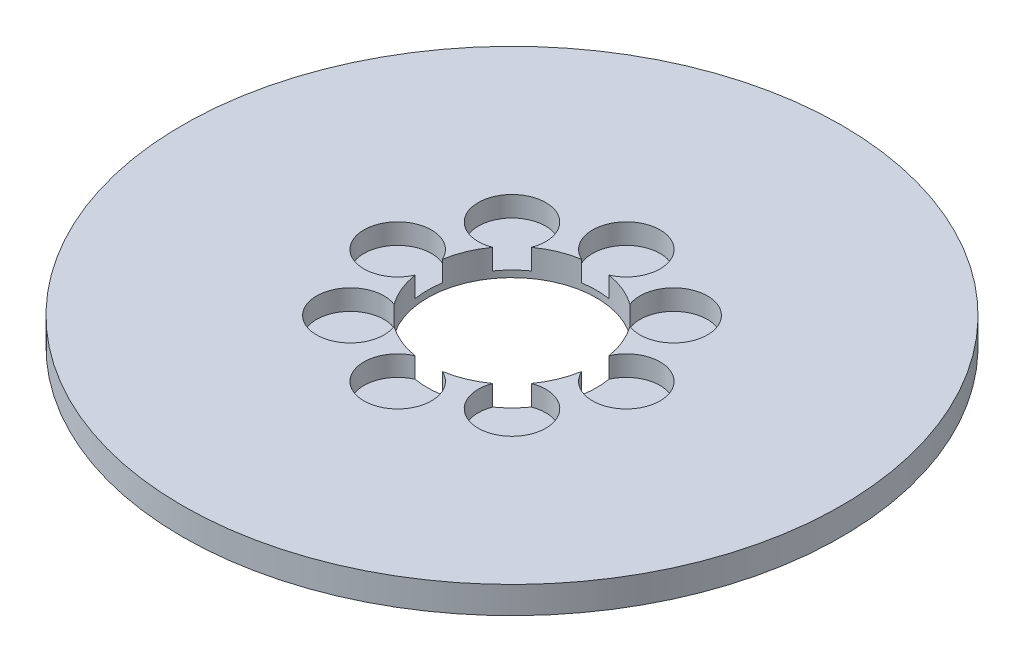
ISO-10303-21;
HEADER;
FILE_DESCRIPTION(('STEP AP214'),'2;1');
FILE_NAME('part.step','',(''),(''),'','','');
FILE_SCHEMA(('AUTOMOTIVE_DESIGN { 1 0 10303 214 1 1 1 1 }'));
ENDSEC;
DATA;
#1=APPLICATION_CONTEXT('core data for automotive mechanical design processes');
#2=APPLICATION_PROTOCOL_DEFINITION('international standard','automotive_design',2000,#1);
#3=PRODUCT_CONTEXT('',#1,'mechanical');
#4=PRODUCT('Part','Part','',(#3));
#5=PRODUCT_RELATED_PRODUCT_CATEGORY('part','',(#4));
#6=PRODUCT_DEFINITION_FORMATION('','',#4);
#7=PRODUCT_DEFINITION_CONTEXT('part definition',#1,'design');
#8=PRODUCT_DEFINITION('design','',#6,#7);
#9=PRODUCT_DEFINITION_SHAPE('','',#8);
#10=(LENGTH_UNIT() NAMED_UNIT(*) SI_UNIT(.MILLI.,.METRE.));
#11=(NAMED_UNIT(*) PLANE_ANGLE_UNIT() SI_UNIT($,.RADIAN.));
#12=(NAMED_UNIT(*) SI_UNIT($,.STERADIAN.) SOLID_ANGLE_UNIT());
#13=UNCERTAINTY_MEASURE_WITH_UNIT(LENGTH_MEASURE(1.E-05),#10,'distance_accuracy_value','');
#14=(GEOMETRIC_REPRESENTATION_CONTEXT(3) GLOBAL_UNCERTAINTY_ASSIGNED_CONTEXT((#13)) GLOBAL_UNIT_ASSIGNED_CONTEXT((#10,
#11,#12)) REPRESENTATION_CONTEXT('',''));
#15=CARTESIAN_POINT('',(0.,0.,0.));
#16=DIRECTION('',(0.,0.,1.));
#17=DIRECTION('',(1.,0.,0.));
#18=AXIS2_PLACEMENT_3D('',#15,#16,#17);
#19=CARTESIAN_POINT('',(0.,8.,0.));
#20=DIRECTION('',(0.,-1.,0.));
#21=DIRECTION('',(0.,0.,-1.));
#22=AXIS2_PLACEMENT_3D('',#19,#20,#21);
#23=CYLINDRICAL_SURFACE('',#22,97.5);
#24=CARTESIAN_POINT('',(0.,8.,0.));
#25=DIRECTION('',(0.,1.,0.));
#26=DIRECTION('',(0.,0.,1.));
#27=AXIS2_PLACEMENT_3D('',#24,#25,#26);
#28=CIRCLE('',#27,97.5);
#29=CARTESIAN_POINT('',(0.,8.,97.5));
#30=VERTEX_POINT('',#29);
#31=EDGE_CURVE('E195',#30,#30,#28,.T.);
#32=ORIENTED_EDGE('',*,*,#31,.F.);
#33=EDGE_LOOP('',(#32));
#34=FACE_BOUND('',#33,.T.);
#35=CARTESIAN_POINT('',(0.,0.,0.));
#36=DIRECTION('',(0.,1.,0.));
#37=DIRECTION('',(0.,0.,1.));
#38=AXIS2_PLACEMENT_3D('',#35,#36,#37);
#39=CIRCLE('',#38,97.5);
#40=CARTESIAN_POINT('',(0.,0.,97.5));
#41=VERTEX_POINT('',#40);
#42=EDGE_CURVE('E179',#41,#41,#39,.T.);
#43=ORIENTED_EDGE('',*,*,#42,.T.);
#44=EDGE_LOOP('',(#43));
#45=FACE_BOUND('',#44,.T.);
#46=ADVANCED_FACE('F39',(#34,#45),#23,.T.);
#47=CARTESIAN_POINT('',(0.,8.,0.));
#48=DIRECTION('',(0.,1.,0.));
#49=DIRECTION('',(0.,0.,1.));
#50=AXIS2_PLACEMENT_3D('',#47,#48,#49);
#51=PLANE('',#50);
#52=CARTESIAN_POINT('',(1.18084923532619E-13,8.,33.8208662950337));
#53=DIRECTION('',(0.,1.,0.));
#54=DIRECTION('',(1.,0.,0.));
#55=AXIS2_PLACEMENT_3D('',#52,#53,#54);
#56=CIRCLE('',#55,10.);
#57=CARTESIAN_POINT('',(-4.03691324760704,8.,24.6719138177664));
#58=VERTEX_POINT('',#57);
#59=CARTESIAN_POINT('',(4.03691324760721,8.,24.6719138177664));
#60=VERTEX_POINT('',#59);
#61=EDGE_CURVE('E176',#58,#60,#56,.T.);
#62=ORIENTED_EDGE('',*,*,#61,.F.);
#63=CARTESIAN_POINT('',(0.,8.,0.));
#64=DIRECTION('',(0.,1.,0.));
#65=DIRECTION('',(0.,0.,1.));
#66=AXIS2_PLACEMENT_3D('',#63,#64,#65);
#67=CIRCLE('',#66,25.);
#68=CARTESIAN_POINT('',(-14.5911488329479,8.,20.3002062978376));
#69=VERTEX_POINT('',#68);
#70=EDGE_CURVE('E166',#69,#58,#67,.T.);
#71=ORIENTED_EDGE('',*,*,#70,.F.);
#72=CARTESIAN_POINT('',(-23.9149639028218,8.,23.9149639028219));
#73=DIRECTION('',(0.,1.,0.));
#74=DIRECTION('',(0.707106781186549,0.,0.707106781186546));
#75=AXIS2_PLACEMENT_3D('',#72,#73,#74);
#76=CIRCLE('',#75,10.);
#77=CARTESIAN_POINT('',(-20.3002062978375,8.,14.591148832948));
#78=VERTEX_POINT('',#77);
#79=EDGE_CURVE('E147',#78,#69,#76,.T.);
#80=ORIENTED_EDGE('',*,*,#79,.F.);
#81=CARTESIAN_POINT('',(-24.6719138177664,8.,4.03691324760713));
#82=VERTEX_POINT('',#81);
#83=EDGE_CURVE('E180',#82,#78,#67,.T.);
#84=ORIENTED_EDGE('',*,*,#83,.F.);
#85=CARTESIAN_POINT('',(-33.8208662950337,8.,0.));
#86=DIRECTION('',(0.,1.,0.));
#87=DIRECTION('',(0.,0.,1.));
#88=AXIS2_PLACEMENT_3D('',#85,#86,#87);
#89=CIRCLE('',#88,10.);
#90=CARTESIAN_POINT('',(-24.6719138177664,8.,-4.03691324760713));
#91=VERTEX_POINT('',#90);
#92=EDGE_CURVE('E186',#91,#82,#89,.T.);
#93=ORIENTED_EDGE('',*,*,#92,.F.);
#94=CARTESIAN_POINT('',(-20.3002062978377,8.,-14.5911488329477));
#95=VERTEX_POINT('',#94);
#96=EDGE_CURVE('E182',#95,#91,#67,.T.);
#97=ORIENTED_EDGE('',*,*,#96,.F.);
#98=CARTESIAN_POINT('',(-23.9149639028221,8.,-23.9149639028216));
#99=DIRECTION('',(0.,1.,0.));
#100=DIRECTION('',(-0.707106781186539,0.,0.707106781186556));
#101=AXIS2_PLACEMENT_3D('',#98,#99,#100);
#102=CIRCLE('',#101,10.);
#103=CARTESIAN_POINT('',(-14.5911488329482,8.,-20.3002062978374));
#104=VERTEX_POINT('',#103);
#105=EDGE_CURVE('E446',#104,#95,#102,.T.);
#106=ORIENTED_EDGE('',*,*,#105,.F.);
#107=CARTESIAN_POINT('',(-4.03691324760739,8.,-24.6719138177664));
#108=VERTEX_POINT('',#107);
#109=EDGE_CURVE('E452',#108,#104,#67,.T.);
#110=ORIENTED_EDGE('',*,*,#109,.F.);
#111=CARTESIAN_POINT('',(-3.54254770597856E-13,8.,-33.8208662950337));
#112=DIRECTION('',(0.,1.,0.));
#113=DIRECTION('',(-1.,0.,0.));
#114=AXIS2_PLACEMENT_3D('',#111,#112,#113);
#115=CIRCLE('',#114,10.);
#116=CARTESIAN_POINT('',(4.03691324760687,8.,-24.6719138177665));
#117=VERTEX_POINT('',#116);
#118=EDGE_CURVE('E477',#117,#108,#115,.T.);
#119=ORIENTED_EDGE('',*,*,#118,.F.);
#120=CARTESIAN_POINT('',(14.5911488329477,8.,-20.3002062978377));
#121=VERTEX_POINT('',#120);
#122=EDGE_CURVE('E460',#121,#117,#67,.T.);
#123=ORIENTED_EDGE('',*,*,#122,.F.);
#124=CARTESIAN_POINT('',(23.9149639028216,8.,-23.9149639028221));
#125=DIRECTION('',(0.,1.,0.));
#126=DIRECTION('',(-0.707106781186554,0.,-0.707106781186541));
#127=AXIS2_PLACEMENT_3D('',#124,#125,#126);
#128=CIRCLE('',#127,10.);
#129=CARTESIAN_POINT('',(20.3002062978374,8.,-14.5911488329481));
#130=VERTEX_POINT('',#129);
#131=EDGE_CURVE('E464',#130,#121,#128,.T.);
#132=ORIENTED_EDGE('',*,*,#131,.F.);
#133=CARTESIAN_POINT('',(24.6719138177664,8.,-4.03691324760713));
#134=VERTEX_POINT('',#133);
#135=EDGE_CURVE('E459',#134,#130,#67,.T.);
#136=ORIENTED_EDGE('',*,*,#135,.F.);
#137=CARTESIAN_POINT('',(33.8208662950337,8.,0.));
#138=DIRECTION('',(0.,1.,0.));
#139=DIRECTION('',(0.,0.,-1.));
#140=AXIS2_PLACEMENT_3D('',#137,#138,#139);
#141=CIRCLE('',#140,10.);
#142=CARTESIAN_POINT('',(24.6719138177664,8.,4.03691324760713));
#143=VERTEX_POINT('',#142);
#144=EDGE_CURVE('E469',#143,#134,#141,.T.);
#145=ORIENTED_EDGE('',*,*,#144,.F.);
#146=CARTESIAN_POINT('',(20.3002062978376,8.,14.5911488329478));
#147=VERTEX_POINT('',#146);
#148=EDGE_CURVE('E181',#147,#143,#67,.T.);
#149=ORIENTED_EDGE('',*,*,#148,.F.);
#150=CARTESIAN_POINT('',(23.914963902822,8.,23.9149639028217));
#151=DIRECTION('',(0.,1.,0.));
#152=DIRECTION('',(0.707106781186544,0.,-0.707106781186551));
#153=AXIS2_PLACEMENT_3D('',#150,#151,#152);
#154=CIRCLE('',#153,10.);
#155=CARTESIAN_POINT('',(14.591148832948,8.,20.3002062978375));
#156=VERTEX_POINT('',#155);
#157=EDGE_CURVE('E475',#156,#147,#154,.T.);
#158=ORIENTED_EDGE('',*,*,#157,.F.);
#159=EDGE_CURVE('E177',#60,#156,#67,.T.);
#160=ORIENTED_EDGE('',*,*,#159,.F.);
#161=EDGE_LOOP('',(#62,#71,#80,#84,#93,#97,#106,#110,#119,#123,#132,#136,#145,#149,#158,#160));
#162=FACE_BOUND('',#161,.T.);
#163=ORIENTED_EDGE('',*,*,#31,.T.);
#164=EDGE_LOOP('',(#163));
#165=FACE_BOUND('',#164,.T.);
#166=ADVANCED_FACE('F172',(#162,#165),#51,.T.);
#167=CARTESIAN_POINT('',(0.,0.,0.));
#168=DIRECTION('',(0.,1.,0.));
#169=DIRECTION('',(0.,0.,1.));
#170=AXIS2_PLACEMENT_3D('',#167,#168,#169);
#171=PLANE('',#170);
#172=CARTESIAN_POINT('',(0.,0.,0.));
#173=DIRECTION('',(0.,1.,0.));
#174=DIRECTION('',(0.,0.,1.));
#175=AXIS2_PLACEMENT_3D('',#172,#173,#174);
#176=CIRCLE('',#175,25.);
#177=CARTESIAN_POINT('',(0.,0.,25.));
#178=VERTEX_POINT('',#177);
#179=EDGE_CURVE('E187',#178,#178,#176,.T.);
#180=ORIENTED_EDGE('',*,*,#179,.T.);
#181=EDGE_LOOP('',(#180));
#182=FACE_BOUND('',#181,.T.);
#183=ORIENTED_EDGE('',*,*,#42,.F.);
#184=EDGE_LOOP('',(#183));
#185=FACE_BOUND('',#184,.T.);
#186=ADVANCED_FACE('F270',(#182,#185),#171,.F.);
#187=CARTESIAN_POINT('',(0.,8.,0.));
#188=DIRECTION('',(0.,-1.,0.));
#189=DIRECTION('',(0.,0.,-1.));
#190=AXIS2_PLACEMENT_3D('',#187,#188,#189);
#191=CYLINDRICAL_SURFACE('',#190,25.);
#192=DIRECTION('',(0.,1.,0.));
#193=VECTOR('',#192,1.);
#194=CARTESIAN_POINT('',(-4.03691324760705,4.97823933550777,24.6719138177664));
#195=LINE('',#194,#193);
#196=CARTESIAN_POINT('',(-4.03691324760704,1.95647867101555,24.6719138177664));
#197=VERTEX_POINT('',#196);
#198=EDGE_CURVE('E11',#197,#58,#195,.T.);
#199=ORIENTED_EDGE('',*,*,#198,.F.);
#200=CARTESIAN_POINT('',(0.,1.95647867101555,0.));
#201=DIRECTION('',(0.,1.,0.));
#202=DIRECTION('',(0.,0.,1.));
#203=AXIS2_PLACEMENT_3D('',#200,#201,#202);
#204=CIRCLE('',#203,25.);
#205=CARTESIAN_POINT('',(4.03691324760721,1.95647867101555,24.6719138177664));
#206=VERTEX_POINT('',#205);
#207=EDGE_CURVE('E250',#197,#206,#204,.T.);
#208=ORIENTED_EDGE('',*,*,#207,.T.);
#209=DIRECTION('',(0.,1.,0.));
#210=VECTOR('',#209,1.);
#211=CARTESIAN_POINT('',(4.03691324760722,4.97823933550777,24.6719138177664));
#212=LINE('',#211,#210);
#213=EDGE_CURVE('E46',#60,#206,#212,.F.);
#214=ORIENTED_EDGE('',*,*,#213,.F.);
#215=ORIENTED_EDGE('',*,*,#159,.T.);
#216=DIRECTION('',(0.,1.,0.));
#217=VECTOR('',#216,1.);
#218=CARTESIAN_POINT('',(14.591148832948,4.97823933550777,20.3002062978375));
#219=LINE('',#218,#217);
#220=CARTESIAN_POINT('',(14.591148832948,1.95647867101555,20.3002062978375));
#221=VERTEX_POINT('',#220);
#222=EDGE_CURVE('E244',#221,#156,#219,.T.);
#223=ORIENTED_EDGE('',*,*,#222,.F.);
#224=CARTESIAN_POINT('',(0.,1.95647867101555,0.));
#225=DIRECTION('',(0.,1.,0.));
#226=DIRECTION('',(0.,0.,1.));
#227=AXIS2_PLACEMENT_3D('',#224,#225,#226);
#228=CIRCLE('',#227,25.);
#229=CARTESIAN_POINT('',(20.3002062978376,1.95647867101555,14.5911488329478));
#230=VERTEX_POINT('',#229);
#231=EDGE_CURVE('E238',#221,#230,#228,.T.);
#232=ORIENTED_EDGE('',*,*,#231,.T.);
#233=DIRECTION('',(0.,1.,0.));
#234=VECTOR('',#233,1.);
#235=CARTESIAN_POINT('',(20.3002062978376,4.97823933550777,14.5911488329478));
#236=LINE('',#235,#234);
#237=EDGE_CURVE('E242',#147,#230,#236,.F.);
#238=ORIENTED_EDGE('',*,*,#237,.F.);
#239=ORIENTED_EDGE('',*,*,#148,.T.);
#240=DIRECTION('',(0.,1.,0.));
#241=VECTOR('',#240,1.);
#242=CARTESIAN_POINT('',(24.6719138177664,4.97823933550777,4.03691324760713));
#243=LINE('',#242,#241);
#244=CARTESIAN_POINT('',(24.6719138177664,1.95647867101555,4.03691324760713));
#245=VERTEX_POINT('',#244);
#246=EDGE_CURVE('E236',#245,#143,#243,.T.);
#247=ORIENTED_EDGE('',*,*,#246,.F.);
#248=CARTESIAN_POINT('',(0.,1.95647867101555,0.));
#249=DIRECTION('',(0.,1.,0.));
#250=DIRECTION('',(0.,0.,1.));
#251=AXIS2_PLACEMENT_3D('',#248,#249,#250);
#252=CIRCLE('',#251,25.);
#253=CARTESIAN_POINT('',(24.6719138177664,1.95647867101555,-4.03691324760713));
#254=VERTEX_POINT('',#253);
#255=EDGE_CURVE('E235',#245,#254,#252,.T.);
#256=ORIENTED_EDGE('',*,*,#255,.T.);
#257=DIRECTION('',(0.,1.,0.));
#258=VECTOR('',#257,1.);
#259=CARTESIAN_POINT('',(24.6719138177664,4.97823933550777,-4.03691324760713));
#260=LINE('',#259,#258);
#261=EDGE_CURVE('E234',#134,#254,#260,.F.);
#262=ORIENTED_EDGE('',*,*,#261,.F.);
#263=ORIENTED_EDGE('',*,*,#135,.T.);
#264=DIRECTION('',(0.,1.,0.));
#265=VECTOR('',#264,1.);
#266=CARTESIAN_POINT('',(20.3002062978374,4.97823933550777,-14.5911488329481));
#267=LINE('',#266,#265);
#268=CARTESIAN_POINT('',(20.3002062978374,1.95647867101555,-14.5911488329481));
#269=VERTEX_POINT('',#268);
#270=EDGE_CURVE('E229',#269,#130,#267,.T.);
#271=ORIENTED_EDGE('',*,*,#270,.F.);
#272=CARTESIAN_POINT('',(0.,1.95647867101555,0.));
#273=DIRECTION('',(0.,1.,0.));
#274=DIRECTION('',(0.,0.,1.));
#275=AXIS2_PLACEMENT_3D('',#272,#273,#274);
#276=CIRCLE('',#275,25.);
#277=CARTESIAN_POINT('',(14.5911488329477,1.95647867101555,-20.3002062978377));
#278=VERTEX_POINT('',#277);
#279=EDGE_CURVE('E221',#269,#278,#276,.T.);
#280=ORIENTED_EDGE('',*,*,#279,.T.);
#281=DIRECTION('',(0.,1.,0.));
#282=VECTOR('',#281,1.);
#283=CARTESIAN_POINT('',(14.5911488329477,4.97823933550777,-20.3002062978377));
#284=LINE('',#283,#282);
#285=EDGE_CURVE('E230',#121,#278,#284,.F.);
#286=ORIENTED_EDGE('',*,*,#285,.F.);
#287=ORIENTED_EDGE('',*,*,#122,.T.);
#288=DIRECTION('',(0.,1.,0.));
#289=VECTOR('',#288,1.);
#290=CARTESIAN_POINT('',(4.03691324760688,4.97823933550777,-24.6719138177665));
#291=LINE('',#290,#289);
#292=CARTESIAN_POINT('',(4.03691324760687,1.95647867101555,-24.6719138177665));
#293=VERTEX_POINT('',#292);
#294=EDGE_CURVE('E225',#293,#117,#291,.T.);
#295=ORIENTED_EDGE('',*,*,#294,.F.);
#296=CARTESIAN_POINT('',(0.,1.95647867101555,0.));
#297=DIRECTION('',(0.,1.,0.));
#298=DIRECTION('',(0.,0.,1.));
#299=AXIS2_PLACEMENT_3D('',#296,#297,#298);
#300=CIRCLE('',#299,25.);
#301=CARTESIAN_POINT('',(-4.03691324760739,1.95647867101555,-24.6719138177664));
#302=VERTEX_POINT('',#301);
#303=EDGE_CURVE('E216',#293,#302,#300,.T.);
#304=ORIENTED_EDGE('',*,*,#303,.T.);
#305=DIRECTION('',(0.,1.,0.));
#306=VECTOR('',#305,1.);
#307=CARTESIAN_POINT('',(-4.03691324760739,4.97823933550777,-24.6719138177664));
#308=LINE('',#307,#306);
#309=EDGE_CURVE('E218',#108,#302,#308,.F.);
#310=ORIENTED_EDGE('',*,*,#309,.F.);
#311=ORIENTED_EDGE('',*,*,#109,.T.);
#312=DIRECTION('',(0.,1.,0.));
#313=VECTOR('',#312,1.);
#314=CARTESIAN_POINT('',(-14.5911488329482,4.97823933550777,-20.3002062978374));
#315=LINE('',#314,#313);
#316=CARTESIAN_POINT('',(-14.5911488329482,1.95647867101555,-20.3002062978374));
#317=VERTEX_POINT('',#316);
#318=EDGE_CURVE('E212',#317,#104,#315,.T.);
#319=ORIENTED_EDGE('',*,*,#318,.F.);
#320=CARTESIAN_POINT('',(0.,1.95647867101555,0.));
#321=DIRECTION('',(0.,1.,0.));
#322=DIRECTION('',(0.,0.,1.));
#323=AXIS2_PLACEMENT_3D('',#320,#321,#322);
#324=CIRCLE('',#323,25.);
#325=CARTESIAN_POINT('',(-20.3002062978377,1.95647867101555,-14.5911488329477));
#326=VERTEX_POINT('',#325);
#327=EDGE_CURVE('E208',#317,#326,#324,.T.);
#328=ORIENTED_EDGE('',*,*,#327,.T.);
#329=DIRECTION('',(0.,1.,0.));
#330=VECTOR('',#329,1.);
#331=CARTESIAN_POINT('',(-20.3002062978377,4.97823933550777,-14.5911488329477));
#332=LINE('',#331,#330);
#333=EDGE_CURVE('E211',#95,#326,#332,.F.);
#334=ORIENTED_EDGE('',*,*,#333,.F.);
#335=ORIENTED_EDGE('',*,*,#96,.T.);
#336=DIRECTION('',(0.,1.,0.));
#337=VECTOR('',#336,1.);
#338=CARTESIAN_POINT('',(-24.6719138177664,4.97823933550777,-4.03691324760713));
#339=LINE('',#338,#337);
#340=CARTESIAN_POINT('',(-24.6719138177664,1.95647867101555,-4.03691324760713));
#341=VERTEX_POINT('',#340);
#342=EDGE_CURVE('E201',#341,#91,#339,.T.);
#343=ORIENTED_EDGE('',*,*,#342,.F.);
#344=CARTESIAN_POINT('',(0.,1.95647867101555,0.));
#345=DIRECTION('',(0.,1.,0.));
#346=DIRECTION('',(0.,0.,1.));
#347=AXIS2_PLACEMENT_3D('',#344,#345,#346);
#348=CIRCLE('',#347,25.);
#349=CARTESIAN_POINT('',(-24.6719138177664,1.95647867101555,4.03691324760713));
#350=VERTEX_POINT('',#349);
#351=EDGE_CURVE('E194',#341,#350,#348,.T.);
#352=ORIENTED_EDGE('',*,*,#351,.T.);
#353=DIRECTION('',(0.,1.,0.));
#354=VECTOR('',#353,1.);
#355=CARTESIAN_POINT('',(-24.6719138177664,4.97823933550777,4.03691324760713));
#356=LINE('',#355,#354);
#357=EDGE_CURVE('E199',#82,#350,#356,.F.);
#358=ORIENTED_EDGE('',*,*,#357,.F.);
#359=ORIENTED_EDGE('',*,*,#83,.T.);
#360=DIRECTION('',(0.,1.,0.));
#361=VECTOR('',#360,1.);
#362=CARTESIAN_POINT('',(-20.3002062978375,4.97823933550777,14.591148832948));
#363=LINE('',#362,#361);
#364=CARTESIAN_POINT('',(-20.3002062978375,1.95647867101555,14.591148832948));
#365=VERTEX_POINT('',#364);
#366=EDGE_CURVE('E160',#365,#78,#363,.T.);
#367=ORIENTED_EDGE('',*,*,#366,.F.);
#368=CARTESIAN_POINT('',(0.,1.95647867101555,0.));
#369=DIRECTION('',(0.,1.,0.));
#370=DIRECTION('',(0.,0.,1.));
#371=AXIS2_PLACEMENT_3D('',#368,#369,#370);
#372=CIRCLE('',#371,25.);
#373=CARTESIAN_POINT('',(-14.5911488329479,1.95647867101555,20.3002062978376));
#374=VERTEX_POINT('',#373);
#375=EDGE_CURVE('E168',#365,#374,#372,.T.);
#376=ORIENTED_EDGE('',*,*,#375,.T.);
#377=DIRECTION('',(0.,1.,0.));
#378=VECTOR('',#377,1.);
#379=CARTESIAN_POINT('',(-14.5911488329479,4.97823933550777,20.3002062978376));
#380=LINE('',#379,#378);
#381=EDGE_CURVE('E152',#69,#374,#380,.F.);
#382=ORIENTED_EDGE('',*,*,#381,.F.);
#383=ORIENTED_EDGE('',*,*,#70,.T.);
#384=EDGE_LOOP('',(#199,#208,#214,#215,#223,#232,#238,#239,#247,#256,#262,#263,#271,#280,#286,
#287,#295,#304,#310,#311,#319,#328,#334,#335,#343,#352,#358,#359,#367,#376,#382,#383));
#385=FACE_BOUND('',#384,.T.);
#386=ORIENTED_EDGE('',*,*,#179,.F.);
#387=EDGE_LOOP('',(#386));
#388=FACE_BOUND('',#387,.T.);
#389=ADVANCED_FACE('F170',(#385,#388),#191,.F.);
#390=CARTESIAN_POINT('',(-33.8208662950337,1.95647867101555,0.));
#391=DIRECTION('',(0.,1.,0.));
#392=DIRECTION('',(0.,0.,1.));
#393=AXIS2_PLACEMENT_3D('',#390,#391,#392);
#394=CYLINDRICAL_SURFACE('',#393,10.);
#395=ORIENTED_EDGE('',*,*,#342,.T.);
#396=ORIENTED_EDGE('',*,*,#92,.T.);
#397=ORIENTED_EDGE('',*,*,#357,.T.);
#398=CARTESIAN_POINT('',(-33.8208662950337,1.95647867101555,0.));
#399=DIRECTION('',(0.,1.,0.));
#400=DIRECTION('',(0.,0.,1.));
#401=AXIS2_PLACEMENT_3D('',#398,#399,#400);
#402=CIRCLE('',#401,10.);
#403=EDGE_CURVE('E191',#341,#350,#402,.T.);
#404=ORIENTED_EDGE('',*,*,#403,.F.);
#405=EDGE_LOOP('',(#395,#396,#397,#404));
#406=FACE_BOUND('',#405,.T.);
#407=ADVANCED_FACE('F279',(#406),#394,.F.);
#408=CARTESIAN_POINT('',(-33.8208662950337,1.95647867101555,0.));
#409=DIRECTION('',(0.,1.,0.));
#410=DIRECTION('',(0.,0.,1.));
#411=AXIS2_PLACEMENT_3D('',#408,#409,#410);
#412=PLANE('',#411);
#413=ORIENTED_EDGE('',*,*,#403,.T.);
#414=ORIENTED_EDGE('',*,*,#351,.F.);
#415=EDGE_LOOP('',(#413,#414));
#416=FACE_BOUND('',#415,.T.);
#417=ADVANCED_FACE('F285',(#416),#412,.T.);
#418=CARTESIAN_POINT('',(-23.9149639028218,1.95647867101555,23.9149639028219));
#419=DIRECTION('',(0.,1.,0.));
#420=DIRECTION('',(0.,0.,1.));
#421=AXIS2_PLACEMENT_3D('',#418,#419,#420);
#422=CYLINDRICAL_SURFACE('',#421,10.);
#423=ORIENTED_EDGE('',*,*,#366,.T.);
#424=ORIENTED_EDGE('',*,*,#79,.T.);
#425=ORIENTED_EDGE('',*,*,#381,.T.);
#426=CARTESIAN_POINT('',(-23.9149639028218,1.95647867101555,23.9149639028219));
#427=DIRECTION('',(0.,1.,0.));
#428=DIRECTION('',(0.707106781186549,0.,0.707106781186546));
#429=AXIS2_PLACEMENT_3D('',#426,#427,#428);
#430=CIRCLE('',#429,10.);
#431=EDGE_CURVE('E165',#365,#374,#430,.T.);
#432=ORIENTED_EDGE('',*,*,#431,.F.);
#433=EDGE_LOOP('',(#423,#424,#425,#432));
#434=FACE_BOUND('',#433,.T.);
#435=ADVANCED_FACE('F155',(#434),#422,.F.);
#436=CARTESIAN_POINT('',(-23.9149639028218,1.95647867101555,23.9149639028219));
#437=DIRECTION('',(0.,1.,0.));
#438=DIRECTION('',(0.707106781186549,0.,0.707106781186546));
#439=AXIS2_PLACEMENT_3D('',#436,#437,#438);
#440=PLANE('',#439);
#441=ORIENTED_EDGE('',*,*,#431,.T.);
#442=ORIENTED_EDGE('',*,*,#375,.F.);
#443=EDGE_LOOP('',(#441,#442));
#444=FACE_BOUND('',#443,.T.);
#445=ADVANCED_FACE('F288',(#444),#440,.T.);
#446=CARTESIAN_POINT('',(-23.9149639028221,1.95647867101555,-23.9149639028216));
#447=DIRECTION('',(0.,1.,0.));
#448=DIRECTION('',(0.,0.,1.));
#449=AXIS2_PLACEMENT_3D('',#446,#447,#448);
#450=CYLINDRICAL_SURFACE('',#449,10.);
#451=ORIENTED_EDGE('',*,*,#318,.T.);
#452=ORIENTED_EDGE('',*,*,#105,.T.);
#453=ORIENTED_EDGE('',*,*,#333,.T.);
#454=CARTESIAN_POINT('',(-23.9149639028221,1.95647867101555,-23.9149639028216));
#455=DIRECTION('',(0.,1.,0.));
#456=DIRECTION('',(-0.707106781186539,0.,0.707106781186556));
#457=AXIS2_PLACEMENT_3D('',#454,#455,#456);
#458=CIRCLE('',#457,10.);
#459=EDGE_CURVE('E447',#317,#326,#458,.T.);
#460=ORIENTED_EDGE('',*,*,#459,.F.);
#461=EDGE_LOOP('',(#451,#452,#453,#460));
#462=FACE_BOUND('',#461,.T.);
#463=ADVANCED_FACE('F295',(#462),#450,.F.);
#464=CARTESIAN_POINT('',(-23.9149639028221,1.95647867101555,-23.9149639028216));
#465=DIRECTION('',(0.,1.,0.));
#466=DIRECTION('',(-0.707106781186539,0.,0.707106781186556));
#467=AXIS2_PLACEMENT_3D('',#464,#465,#466);
#468=PLANE('',#467);
#469=ORIENTED_EDGE('',*,*,#459,.T.);
#470=ORIENTED_EDGE('',*,*,#327,.F.);
#471=EDGE_LOOP('',(#469,#470));
#472=FACE_BOUND('',#471,.T.);
#473=ADVANCED_FACE('F375',(#472),#468,.T.);
#474=CARTESIAN_POINT('',(-3.54254770597856E-13,1.95647867101555,-33.8208662950337));
#475=DIRECTION('',(0.,1.,0.));
#476=DIRECTION('',(0.,0.,1.));
#477=AXIS2_PLACEMENT_3D('',#474,#475,#476);
#478=CYLINDRICAL_SURFACE('',#477,10.);
#479=ORIENTED_EDGE('',*,*,#294,.T.);
#480=ORIENTED_EDGE('',*,*,#118,.T.);
#481=ORIENTED_EDGE('',*,*,#309,.T.);
#482=CARTESIAN_POINT('',(-3.54254770597856E-13,1.95647867101555,-33.8208662950337));
#483=DIRECTION('',(0.,1.,0.));
#484=DIRECTION('',(-1.,0.,0.));
#485=AXIS2_PLACEMENT_3D('',#482,#483,#484);
#486=CIRCLE('',#485,10.);
#487=EDGE_CURVE('E467',#293,#302,#486,.T.);
#488=ORIENTED_EDGE('',*,*,#487,.F.);
#489=EDGE_LOOP('',(#479,#480,#481,#488));
#490=FACE_BOUND('',#489,.T.);
#491=ADVANCED_FACE('F361',(#490),#478,.F.);
#492=CARTESIAN_POINT('',(-3.54254770597856E-13,1.95647867101555,-33.8208662950337));
#493=DIRECTION('',(0.,1.,0.));
#494=DIRECTION('',(-1.,0.,0.));
#495=AXIS2_PLACEMENT_3D('',#492,#493,#494);
#496=PLANE('',#495);
#497=ORIENTED_EDGE('',*,*,#487,.T.);
#498=ORIENTED_EDGE('',*,*,#303,.F.);
#499=EDGE_LOOP('',(#497,#498));
#500=FACE_BOUND('',#499,.T.);
#501=ADVANCED_FACE('F297',(#500),#496,.T.);
#502=CARTESIAN_POINT('',(23.9149639028216,1.95647867101555,-23.9149639028221));
#503=DIRECTION('',(0.,1.,0.));
#504=DIRECTION('',(0.,0.,1.));
#505=AXIS2_PLACEMENT_3D('',#502,#503,#504);
#506=CYLINDRICAL_SURFACE('',#505,10.);
#507=ORIENTED_EDGE('',*,*,#270,.T.);
#508=ORIENTED_EDGE('',*,*,#131,.T.);
#509=ORIENTED_EDGE('',*,*,#285,.T.);
#510=CARTESIAN_POINT('',(23.9149639028216,1.95647867101555,-23.9149639028221));
#511=DIRECTION('',(0.,1.,0.));
#512=DIRECTION('',(-0.707106781186554,0.,-0.707106781186541));
#513=AXIS2_PLACEMENT_3D('',#510,#511,#512);
#514=CIRCLE('',#513,10.);
#515=EDGE_CURVE('E470',#269,#278,#514,.T.);
#516=ORIENTED_EDGE('',*,*,#515,.F.);
#517=EDGE_LOOP('',(#507,#508,#509,#516));
#518=FACE_BOUND('',#517,.T.);
#519=ADVANCED_FACE('F294',(#518),#506,.F.);
#520=CARTESIAN_POINT('',(23.9149639028216,1.95647867101555,-23.9149639028221));
#521=DIRECTION('',(0.,1.,0.));
#522=DIRECTION('',(-0.707106781186554,0.,-0.707106781186541));
#523=AXIS2_PLACEMENT_3D('',#520,#521,#522);
#524=PLANE('',#523);
#525=ORIENTED_EDGE('',*,*,#515,.T.);
#526=ORIENTED_EDGE('',*,*,#279,.F.);
#527=EDGE_LOOP('',(#525,#526));
#528=FACE_BOUND('',#527,.T.);
#529=ADVANCED_FACE('F300',(#528),#524,.T.);
#530=CARTESIAN_POINT('',(33.8208662950337,1.95647867101555,0.));
#531=DIRECTION('',(0.,1.,0.));
#532=DIRECTION('',(0.,0.,1.));
#533=AXIS2_PLACEMENT_3D('',#530,#531,#532);
#534=CYLINDRICAL_SURFACE('',#533,10.);
#535=ORIENTED_EDGE('',*,*,#246,.T.);
#536=ORIENTED_EDGE('',*,*,#144,.T.);
#537=ORIENTED_EDGE('',*,*,#261,.T.);
#538=CARTESIAN_POINT('',(33.8208662950337,1.95647867101555,0.));
#539=DIRECTION('',(0.,1.,0.));
#540=DIRECTION('',(0.,0.,-1.));
#541=AXIS2_PLACEMENT_3D('',#538,#539,#540);
#542=CIRCLE('',#541,10.);
#543=EDGE_CURVE('E472',#245,#254,#542,.T.);
#544=ORIENTED_EDGE('',*,*,#543,.F.);
#545=EDGE_LOOP('',(#535,#536,#537,#544));
#546=FACE_BOUND('',#545,.T.);
#547=ADVANCED_FACE('F305',(#546),#534,.F.);
#548=CARTESIAN_POINT('',(33.8208662950337,1.95647867101555,0.));
#549=DIRECTION('',(0.,1.,0.));
#550=DIRECTION('',(0.,0.,-1.));
#551=AXIS2_PLACEMENT_3D('',#548,#549,#550);
#552=PLANE('',#551);
#553=ORIENTED_EDGE('',*,*,#543,.T.);
#554=ORIENTED_EDGE('',*,*,#255,.F.);
#555=EDGE_LOOP('',(#553,#554));
#556=FACE_BOUND('',#555,.T.);
#557=ADVANCED_FACE('F308',(#556),#552,.T.);
#558=CARTESIAN_POINT('',(23.914963902822,1.95647867101555,23.9149639028217));
#559=DIRECTION('',(0.,1.,0.));
#560=DIRECTION('',(0.,0.,1.));
#561=AXIS2_PLACEMENT_3D('',#558,#559,#560);
#562=CYLINDRICAL_SURFACE('',#561,10.);
#563=ORIENTED_EDGE('',*,*,#222,.T.);
#564=ORIENTED_EDGE('',*,*,#157,.T.);
#565=ORIENTED_EDGE('',*,*,#237,.T.);
#566=CARTESIAN_POINT('',(23.914963902822,1.95647867101555,23.9149639028217));
#567=DIRECTION('',(0.,1.,0.));
#568=DIRECTION('',(0.707106781186544,0.,-0.707106781186551));
#569=AXIS2_PLACEMENT_3D('',#566,#567,#568);
#570=CIRCLE('',#569,10.);
#571=EDGE_CURVE('E56',#221,#230,#570,.T.);
#572=ORIENTED_EDGE('',*,*,#571,.F.);
#573=EDGE_LOOP('',(#563,#564,#565,#572));
#574=FACE_BOUND('',#573,.T.);
#575=ADVANCED_FACE('F309',(#574),#562,.F.);
#576=CARTESIAN_POINT('',(23.914963902822,1.95647867101555,23.9149639028217));
#577=DIRECTION('',(0.,1.,0.));
#578=DIRECTION('',(0.707106781186544,0.,-0.707106781186551));
#579=AXIS2_PLACEMENT_3D('',#576,#577,#578);
#580=PLANE('',#579);
#581=ORIENTED_EDGE('',*,*,#571,.T.);
#582=ORIENTED_EDGE('',*,*,#231,.F.);
#583=EDGE_LOOP('',(#581,#582));
#584=FACE_BOUND('',#583,.T.);
#585=ADVANCED_FACE('F256',(#584),#580,.T.);
#586=CARTESIAN_POINT('',(1.18084923532619E-13,1.95647867101555,33.8208662950337));
#587=DIRECTION('',(0.,1.,0.));
#588=DIRECTION('',(0.,0.,1.));
#589=AXIS2_PLACEMENT_3D('',#586,#587,#588);
#590=CYLINDRICAL_SURFACE('',#589,10.);
#591=ORIENTED_EDGE('',*,*,#198,.T.);
#592=ORIENTED_EDGE('',*,*,#61,.T.);
#593=ORIENTED_EDGE('',*,*,#213,.T.);
#594=CARTESIAN_POINT('',(1.18084923532619E-13,1.95647867101555,33.8208662950337));
#595=DIRECTION('',(0.,1.,0.));
#596=DIRECTION('',(1.,0.,0.));
#597=AXIS2_PLACEMENT_3D('',#594,#595,#596);
#598=CIRCLE('',#597,10.);
#599=EDGE_CURVE('E55',#197,#206,#598,.T.);
#600=ORIENTED_EDGE('',*,*,#599,.F.);
#601=EDGE_LOOP('',(#591,#592,#593,#600));
#602=FACE_BOUND('',#601,.T.);
#603=ADVANCED_FACE('F253',(#602),#590,.F.);
#604=CARTESIAN_POINT('',(1.18084923532619E-13,1.95647867101555,33.8208662950337));
#605=DIRECTION('',(0.,1.,0.));
#606=DIRECTION('',(1.,0.,0.));
#607=AXIS2_PLACEMENT_3D('',#604,#605,#606);
#608=PLANE('',#607);
#609=ORIENTED_EDGE('',*,*,#599,.T.);
#610=ORIENTED_EDGE('',*,*,#207,.F.);
#611=EDGE_LOOP('',(#609,#610));
#612=FACE_BOUND('',#611,.T.);
#613=ADVANCED_FACE('F252',(#612),#608,.T.);
#614=CLOSED_SHELL('',(#46,#166,#186,#389,#407,#417,#435,#445,#463,#473,#491,#501,#519,#529,#547,
#557,#575,#585,#603,#613));
#615=MANIFOLD_SOLID_BREP('B2',#614);
#616=ADVANCED_BREP_SHAPE_REPRESENTATION('',(#18,#615),#14);
#617=SHAPE_DEFINITION_REPRESENTATION(#9,#616);
ENDSEC;
END-ISO-10303-21;
